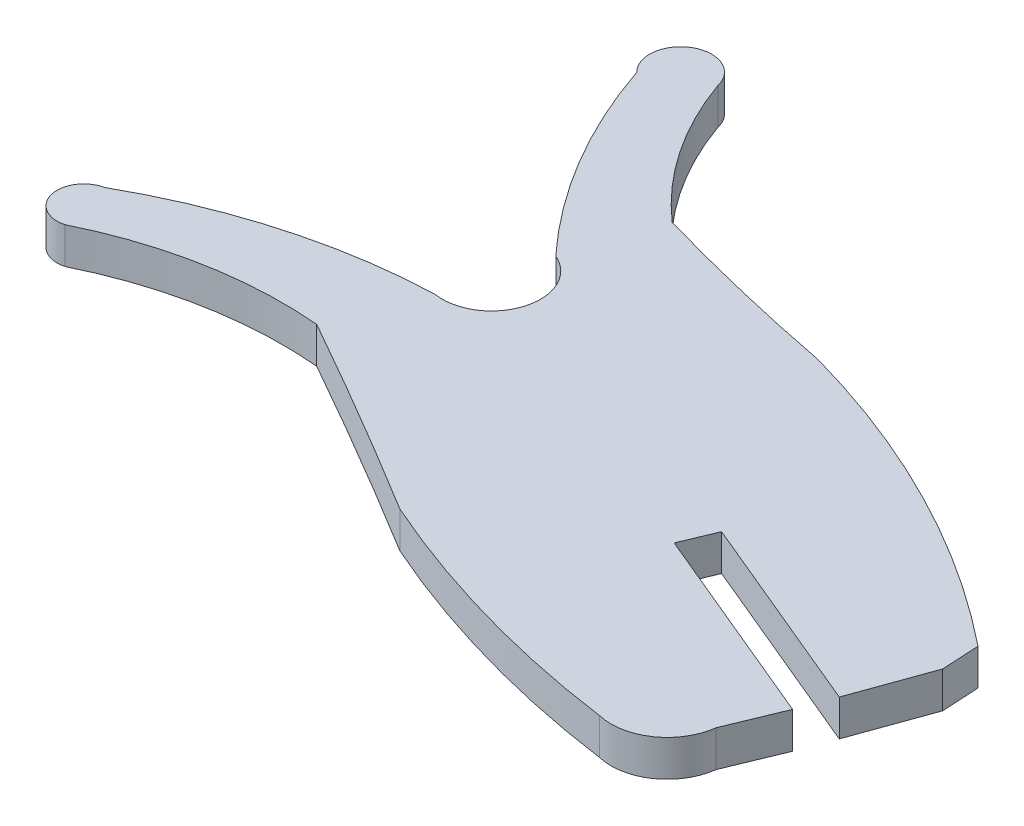
ISO-10303-21;
HEADER;
FILE_DESCRIPTION(('STEP AP214'),'2;1');
FILE_NAME('part.step','',(''),(''),'','','');
FILE_SCHEMA(('AUTOMOTIVE_DESIGN { 1 0 10303 214 1 1 1 1 }'));
ENDSEC;
DATA;
#1=APPLICATION_CONTEXT('core data for automotive mechanical design processes');
#2=APPLICATION_PROTOCOL_DEFINITION('international standard','automotive_design',2000,#1);
#3=PRODUCT_CONTEXT('',#1,'mechanical');
#4=PRODUCT('Part','Part','',(#3));
#5=PRODUCT_RELATED_PRODUCT_CATEGORY('part','',(#4));
#6=PRODUCT_DEFINITION_FORMATION('','',#4);
#7=PRODUCT_DEFINITION_CONTEXT('part definition',#1,'design');
#8=PRODUCT_DEFINITION('design','',#6,#7);
#9=PRODUCT_DEFINITION_SHAPE('','',#8);
#10=(LENGTH_UNIT() NAMED_UNIT(*) SI_UNIT(.MILLI.,.METRE.));
#11=(NAMED_UNIT(*) PLANE_ANGLE_UNIT() SI_UNIT($,.RADIAN.));
#12=(NAMED_UNIT(*) SI_UNIT($,.STERADIAN.) SOLID_ANGLE_UNIT());
#13=UNCERTAINTY_MEASURE_WITH_UNIT(LENGTH_MEASURE(1.E-05),#10,'distance_accuracy_value','');
#14=(GEOMETRIC_REPRESENTATION_CONTEXT(3) GLOBAL_UNCERTAINTY_ASSIGNED_CONTEXT((#13)) GLOBAL_UNIT_ASSIGNED_CONTEXT((#10,
#11,#12)) REPRESENTATION_CONTEXT('',''));
#15=CARTESIAN_POINT('',(0.,0.,0.));
#16=DIRECTION('',(0.,0.,1.));
#17=DIRECTION('',(1.,0.,0.));
#18=AXIS2_PLACEMENT_3D('',#15,#16,#17);
#19=CARTESIAN_POINT('',(-189.331030574793,2.,-516.512038011604));
#20=DIRECTION('',(0.,-1.,0.));
#21=DIRECTION('',(0.,0.,-1.));
#22=AXIS2_PLACEMENT_3D('',#19,#20,#21);
#23=CYLINDRICAL_SURFACE('',#22,2.70360510366939);
#24=CARTESIAN_POINT('',(-189.331030574793,0.,-516.512038011604));
#25=DIRECTION('',(0.,1.,0.));
#26=DIRECTION('',(0.,0.,1.));
#27=AXIS2_PLACEMENT_3D('',#24,#25,#26);
#28=CIRCLE('',#27,2.70360510366939);
#29=CARTESIAN_POINT('',(-189.764879999989,0.,-513.843469999946));
#30=VERTEX_POINT('',#29);
#31=CARTESIAN_POINT('',(-188.274059999991,0.,-519.000469999944));
#32=VERTEX_POINT('',#31);
#33=EDGE_CURVE('E11',#30,#32,#28,.T.);
#34=ORIENTED_EDGE('',*,*,#33,.F.);
#35=DIRECTION('',(0.,-1.,0.));
#36=VECTOR('',#35,1.);
#37=CARTESIAN_POINT('',(-189.764879999989,2.,-513.843469999946));
#38=LINE('',#37,#36);
#39=CARTESIAN_POINT('',(-189.764879999989,2.,-513.843469999946));
#40=VERTEX_POINT('',#39);
#41=EDGE_CURVE('E56',#40,#30,#38,.T.);
#42=ORIENTED_EDGE('',*,*,#41,.F.);
#43=CARTESIAN_POINT('',(-189.331030574793,2.,-516.512038011604));
#44=DIRECTION('',(0.,1.,0.));
#45=DIRECTION('',(0.,0.,1.));
#46=AXIS2_PLACEMENT_3D('',#43,#44,#45);
#47=CIRCLE('',#46,2.70360510366939);
#48=CARTESIAN_POINT('',(-188.274059999991,2.,-519.000469999944));
#49=VERTEX_POINT('',#48);
#50=EDGE_CURVE('E41',#40,#49,#47,.T.);
#51=ORIENTED_EDGE('',*,*,#50,.T.);
#52=DIRECTION('',(0.,-1.,0.));
#53=VECTOR('',#52,1.);
#54=CARTESIAN_POINT('',(-188.274059999991,2.,-519.000469999944));
#55=LINE('',#54,#53);
#56=EDGE_CURVE('E123',#49,#32,#55,.T.);
#57=ORIENTED_EDGE('',*,*,#56,.T.);
#58=EDGE_LOOP('',(#34,#42,#51,#57));
#59=FACE_BOUND('',#58,.T.);
#60=ADVANCED_FACE('F37',(#59),#23,.F.);
#61=CARTESIAN_POINT('',(-188.687048146685,2.,-482.811723343636));
#62=DIRECTION('',(0.,-1.,0.));
#63=DIRECTION('',(0.,0.,-1.));
#64=AXIS2_PLACEMENT_3D('',#61,#62,#63);
#65=CYLINDRICAL_SURFACE('',#64,31.0504592888);
#66=CARTESIAN_POINT('',(-188.687048146685,0.,-482.811723343636));
#67=DIRECTION('',(0.,1.,0.));
#68=DIRECTION('',(0.,0.,1.));
#69=AXIS2_PLACEMENT_3D('',#66,#67,#68);
#70=CIRCLE('',#69,31.0504592888);
#71=CARTESIAN_POINT('',(-203.984990000014,0.,-509.832159999945));
#72=VERTEX_POINT('',#71);
#73=EDGE_CURVE('E47',#30,#72,#70,.T.);
#74=ORIENTED_EDGE('',*,*,#73,.T.);
#75=DIRECTION('',(0.,-1.,0.));
#76=VECTOR('',#75,1.);
#77=CARTESIAN_POINT('',(-203.984990000014,2.,-509.832159999945));
#78=LINE('',#77,#76);
#79=CARTESIAN_POINT('',(-203.984990000014,2.,-509.832159999945));
#80=VERTEX_POINT('',#79);
#81=EDGE_CURVE('E182',#80,#72,#78,.T.);
#82=ORIENTED_EDGE('',*,*,#81,.F.);
#83=CARTESIAN_POINT('',(-188.687048146685,2.,-482.811723343636));
#84=DIRECTION('',(0.,1.,0.));
#85=DIRECTION('',(0.,0.,1.));
#86=AXIS2_PLACEMENT_3D('',#83,#84,#85);
#87=CIRCLE('',#86,31.0504592888);
#88=EDGE_CURVE('E113',#40,#80,#87,.T.);
#89=ORIENTED_EDGE('',*,*,#88,.F.);
#90=ORIENTED_EDGE('',*,*,#41,.T.);
#91=EDGE_LOOP('',(#74,#82,#89,#90));
#92=FACE_BOUND('',#91,.T.);
#93=ADVANCED_FACE('F325',(#92),#65,.T.);
#94=CARTESIAN_POINT('',(-203.690488443121,2.,-508.387803515514));
#95=DIRECTION('',(0.,-1.,0.));
#96=DIRECTION('',(0.,0.,-1.));
#97=AXIS2_PLACEMENT_3D('',#94,#95,#96);
#98=CYLINDRICAL_SURFACE('',#97,1.47407490350001);
#99=CARTESIAN_POINT('',(-203.690488443121,0.,-508.387803515514));
#100=DIRECTION('',(0.,1.,0.));
#101=DIRECTION('',(0.,0.,1.));
#102=AXIS2_PLACEMENT_3D('',#99,#100,#101);
#103=CIRCLE('',#102,1.47407490350001);
#104=CARTESIAN_POINT('',(-203.296920000032,0.,-506.967239999957));
#105=VERTEX_POINT('',#104);
#106=EDGE_CURVE('E186',#72,#105,#103,.T.);
#107=ORIENTED_EDGE('',*,*,#106,.T.);
#108=DIRECTION('',(0.,-1.,0.));
#109=VECTOR('',#108,1.);
#110=CARTESIAN_POINT('',(-203.296920000032,2.,-506.967239999957));
#111=LINE('',#110,#109);
#112=CARTESIAN_POINT('',(-203.296920000032,2.,-506.967239999957));
#113=VERTEX_POINT('',#112);
#114=EDGE_CURVE('E171',#113,#105,#111,.T.);
#115=ORIENTED_EDGE('',*,*,#114,.F.);
#116=CARTESIAN_POINT('',(-203.690488443121,2.,-508.387803515514));
#117=DIRECTION('',(0.,1.,0.));
#118=DIRECTION('',(0.,0.,1.));
#119=AXIS2_PLACEMENT_3D('',#116,#117,#118);
#120=CIRCLE('',#119,1.47407490350001);
#121=EDGE_CURVE('E232',#80,#113,#120,.T.);
#122=ORIENTED_EDGE('',*,*,#121,.F.);
#123=ORIENTED_EDGE('',*,*,#81,.T.);
#124=EDGE_LOOP('',(#107,#115,#122,#123));
#125=FACE_BOUND('',#124,.T.);
#126=ADVANCED_FACE('F187',(#125),#98,.T.);
#127=CARTESIAN_POINT('',(-193.56690373851,2.,-487.20429116561));
#128=DIRECTION('',(0.,-1.,0.));
#129=DIRECTION('',(0.,0.,-1.));
#130=AXIS2_PLACEMENT_3D('',#127,#128,#129);
#131=CYLINDRICAL_SURFACE('',#130,22.0283309190348);
#132=CARTESIAN_POINT('',(-193.56690373851,0.,-487.20429116561));
#133=DIRECTION('',(0.,1.,0.));
#134=DIRECTION('',(0.,0.,1.));
#135=AXIS2_PLACEMENT_3D('',#132,#133,#134);
#136=CIRCLE('',#135,22.0283309190348);
#137=CARTESIAN_POINT('',(-191.599730000241,0.,-509.144610000166));
#138=VERTEX_POINT('',#137);
#139=EDGE_CURVE('E175',#138,#105,#136,.T.);
#140=ORIENTED_EDGE('',*,*,#139,.F.);
#141=DIRECTION('',(0.,-1.,0.));
#142=VECTOR('',#141,1.);
#143=CARTESIAN_POINT('',(-191.599730000241,2.,-509.144610000166));
#144=LINE('',#143,#142);
#145=CARTESIAN_POINT('',(-191.599730000241,2.,-509.144610000166));
#146=VERTEX_POINT('',#145);
#147=EDGE_CURVE('E181',#146,#138,#144,.T.);
#148=ORIENTED_EDGE('',*,*,#147,.F.);
#149=CARTESIAN_POINT('',(-193.56690373851,2.,-487.20429116561));
#150=DIRECTION('',(0.,1.,0.));
#151=DIRECTION('',(0.,0.,1.));
#152=AXIS2_PLACEMENT_3D('',#149,#150,#151);
#153=CIRCLE('',#152,22.0283309190348);
#154=EDGE_CURVE('E178',#146,#113,#153,.T.);
#155=ORIENTED_EDGE('',*,*,#154,.T.);
#156=ORIENTED_EDGE('',*,*,#114,.T.);
#157=EDGE_LOOP('',(#140,#148,#155,#156));
#158=FACE_BOUND('',#157,.T.);
#159=ADVANCED_FACE('F173',(#158),#131,.F.);
#160=CARTESIAN_POINT('',(-358.8726292212,2.,-211.5661836702));
#161=DIRECTION('',(0.,-1.,0.));
#162=DIRECTION('',(0.,0.,-1.));
#163=AXIS2_PLACEMENT_3D('',#160,#161,#162);
#164=CYLINDRICAL_SURFACE('',#163,341.3695104001);
#165=CARTESIAN_POINT('',(-358.8726292212,0.,-211.5661836702));
#166=DIRECTION('',(0.,1.,0.));
#167=DIRECTION('',(0.,0.,1.));
#168=AXIS2_PLACEMENT_3D('',#165,#166,#167);
#169=CIRCLE('',#168,341.3695104001);
#170=CARTESIAN_POINT('',(-180.475929999748,0.,-502.612159999877));
#171=VERTEX_POINT('',#170);
#172=EDGE_CURVE('E193',#171,#138,#169,.T.);
#173=ORIENTED_EDGE('',*,*,#172,.F.);
#174=DIRECTION('',(0.,-1.,0.));
#175=VECTOR('',#174,1.);
#176=CARTESIAN_POINT('',(-180.475929999748,2.,-502.612159999877));
#177=LINE('',#176,#175);
#178=CARTESIAN_POINT('',(-180.475929999748,2.,-502.612159999877));
#179=VERTEX_POINT('',#178);
#180=EDGE_CURVE('E272',#179,#171,#177,.T.);
#181=ORIENTED_EDGE('',*,*,#180,.F.);
#182=CARTESIAN_POINT('',(-358.8726292212,2.,-211.5661836702));
#183=DIRECTION('',(0.,1.,0.));
#184=DIRECTION('',(0.,0.,1.));
#185=AXIS2_PLACEMENT_3D('',#182,#183,#184);
#186=CIRCLE('',#185,341.3695104001);
#187=EDGE_CURVE('E228',#179,#146,#186,.T.);
#188=ORIENTED_EDGE('',*,*,#187,.T.);
#189=ORIENTED_EDGE('',*,*,#147,.T.);
#190=EDGE_LOOP('',(#173,#181,#188,#189));
#191=FACE_BOUND('',#190,.T.);
#192=ADVANCED_FACE('F336',(#191),#164,.F.);
#193=CARTESIAN_POINT('',(-157.259326944354,2.,-555.246809134007));
#194=DIRECTION('',(0.,-1.,0.));
#195=DIRECTION('',(0.,0.,-1.));
#196=AXIS2_PLACEMENT_3D('',#193,#194,#195);
#197=CYLINDRICAL_SURFACE('',#196,57.5275320773);
#198=CARTESIAN_POINT('',(-157.259326944354,0.,-555.246809134007));
#199=DIRECTION('',(0.,1.,0.));
#200=DIRECTION('',(0.,0.,1.));
#201=AXIS2_PLACEMENT_3D('',#198,#199,#200);
#202=CIRCLE('',#201,57.5275320773);
#203=CARTESIAN_POINT('',(-165.109580000002,0.,-498.257420000002));
#204=VERTEX_POINT('',#203);
#205=EDGE_CURVE('E195',#171,#204,#202,.T.);
#206=ORIENTED_EDGE('',*,*,#205,.T.);
#207=DIRECTION('',(0.,-1.,0.));
#208=VECTOR('',#207,1.);
#209=CARTESIAN_POINT('',(-165.109580000002,2.,-498.257420000002));
#210=LINE('',#209,#208);
#211=CARTESIAN_POINT('',(-165.109580000002,2.,-498.257420000002));
#212=VERTEX_POINT('',#211);
#213=EDGE_CURVE('E270',#212,#204,#210,.T.);
#214=ORIENTED_EDGE('',*,*,#213,.F.);
#215=CARTESIAN_POINT('',(-157.259326944354,2.,-555.246809134007));
#216=DIRECTION('',(0.,1.,0.));
#217=DIRECTION('',(0.,0.,1.));
#218=AXIS2_PLACEMENT_3D('',#215,#216,#217);
#219=CIRCLE('',#218,57.5275320773);
#220=EDGE_CURVE('E226',#179,#212,#219,.T.);
#221=ORIENTED_EDGE('',*,*,#220,.F.);
#222=ORIENTED_EDGE('',*,*,#180,.T.);
#223=EDGE_LOOP('',(#206,#214,#221,#222));
#224=FACE_BOUND('',#223,.T.);
#225=ADVANCED_FACE('F268',(#224),#197,.T.);
#226=CARTESIAN_POINT('',(-164.399340185891,2.,-501.272309870571));
#227=DIRECTION('',(0.,-1.,0.));
#228=DIRECTION('',(0.,0.,-1.));
#229=AXIS2_PLACEMENT_3D('',#226,#227,#228);
#230=CYLINDRICAL_SURFACE('',#229,3.09741852599992);
#231=CARTESIAN_POINT('',(-164.399340185891,0.,-501.272309870571));
#232=DIRECTION('',(0.,1.,0.));
#233=DIRECTION('',(0.,0.,1.));
#234=AXIS2_PLACEMENT_3D('',#231,#232,#233);
#235=CIRCLE('',#234,3.09741852599992);
#236=CARTESIAN_POINT('',(-161.32520000002,0.,-500.893279999953));
#237=VERTEX_POINT('',#236);
#238=EDGE_CURVE('E264',#204,#237,#235,.T.);
#239=ORIENTED_EDGE('',*,*,#238,.T.);
#240=DIRECTION('',(0.,-1.,0.));
#241=VECTOR('',#240,1.);
#242=CARTESIAN_POINT('',(-161.32520000002,2.,-500.893279999953));
#243=LINE('',#242,#241);
#244=CARTESIAN_POINT('',(-161.32520000002,2.,-500.893279999953));
#245=VERTEX_POINT('',#244);
#246=EDGE_CURVE('E278',#245,#237,#243,.T.);
#247=ORIENTED_EDGE('',*,*,#246,.F.);
#248=CARTESIAN_POINT('',(-164.399340185891,2.,-501.272309870571));
#249=DIRECTION('',(0.,1.,0.));
#250=DIRECTION('',(0.,0.,1.));
#251=AXIS2_PLACEMENT_3D('',#248,#249,#250);
#252=CIRCLE('',#251,3.09741852599992);
#253=EDGE_CURVE('E224',#212,#245,#252,.T.);
#254=ORIENTED_EDGE('',*,*,#253,.F.);
#255=ORIENTED_EDGE('',*,*,#213,.T.);
#256=EDGE_LOOP('',(#239,#247,#254,#255));
#257=FACE_BOUND('',#256,.T.);
#258=ADVANCED_FACE('F275',(#257),#230,.T.);
#259=CARTESIAN_POINT('',(-189.302934555447,2.,-433.147941485963));
#260=DIRECTION('',(-0.924280853328213,0.,-0.381713117630074));
#261=DIRECTION('',(-0.381713117630074,0.,0.924280853328213));
#262=AXIS2_PLACEMENT_3D('',#259,#260,#261);
#263=PLANE('',#262);
#264=DIRECTION('',(0.381713117630074,0.,-0.924280853328213));
#265=VECTOR('',#264,1.);
#266=CARTESIAN_POINT('',(-189.302934555447,0.,-433.147941485963));
#267=LINE('',#266,#265);
#268=CARTESIAN_POINT('',(-160.09241,0.,-503.87836));
#269=VERTEX_POINT('',#268);
#270=EDGE_CURVE('E262',#237,#269,#267,.T.);
#271=ORIENTED_EDGE('',*,*,#270,.T.);
#272=DIRECTION('',(0.,-1.,0.));
#273=VECTOR('',#272,1.);
#274=CARTESIAN_POINT('',(-160.09241,2.,-503.87836));
#275=LINE('',#274,#273);
#276=CARTESIAN_POINT('',(-160.09241,2.,-503.87836));
#277=VERTEX_POINT('',#276);
#278=EDGE_CURVE('E288',#277,#269,#275,.T.);
#279=ORIENTED_EDGE('',*,*,#278,.F.);
#280=DIRECTION('',(0.381713117630074,0.,-0.924280853328213));
#281=VECTOR('',#280,1.);
#282=CARTESIAN_POINT('',(-189.302934555447,2.,-433.147941485963));
#283=LINE('',#282,#281);
#284=EDGE_CURVE('E222',#245,#277,#283,.T.);
#285=ORIENTED_EDGE('',*,*,#284,.F.);
#286=ORIENTED_EDGE('',*,*,#246,.T.);
#287=EDGE_LOOP('',(#271,#279,#285,#286));
#288=FACE_BOUND('',#287,.T.);
#289=ADVANCED_FACE('F286',(#288),#263,.F.);
#290=CARTESIAN_POINT('',(-495.810163266042,2.,-644.108561638343));
#291=DIRECTION('',(-0.385429779008039,0.,0.922737170300305));
#292=DIRECTION('',(0.922737170300305,0.,0.385429779008039));
#293=AXIS2_PLACEMENT_3D('',#290,#291,#292);
#294=PLANE('',#293);
#295=DIRECTION('',(-0.922737170300305,0.,-0.385429779008039));
#296=VECTOR('',#295,1.);
#297=CARTESIAN_POINT('',(-495.810163266042,0.,-644.108561638343));
#298=LINE('',#297,#296);
#299=CARTESIAN_POINT('',(-171.30699,0.,-508.56272));
#300=VERTEX_POINT('',#299);
#301=EDGE_CURVE('E260',#269,#300,#298,.T.);
#302=ORIENTED_EDGE('',*,*,#301,.T.);
#303=DIRECTION('',(0.,-1.,0.));
#304=VECTOR('',#303,1.);
#305=CARTESIAN_POINT('',(-171.30699,2.,-508.56272));
#306=LINE('',#305,#304);
#307=CARTESIAN_POINT('',(-171.30699,2.,-508.56272));
#308=VERTEX_POINT('',#307);
#309=EDGE_CURVE('E294',#308,#300,#306,.T.);
#310=ORIENTED_EDGE('',*,*,#309,.F.);
#311=DIRECTION('',(-0.922737170300305,0.,-0.385429779008039));
#312=VECTOR('',#311,1.);
#313=CARTESIAN_POINT('',(-495.810163266042,2.,-644.108561638343));
#314=LINE('',#313,#312);
#315=EDGE_CURVE('E220',#277,#308,#314,.T.);
#316=ORIENTED_EDGE('',*,*,#315,.F.);
#317=ORIENTED_EDGE('',*,*,#278,.T.);
#318=EDGE_LOOP('',(#302,#310,#316,#317));
#319=FACE_BOUND('',#318,.T.);
#320=ADVANCED_FACE('F291',(#319),#294,.F.);
#321=CARTESIAN_POINT('',(-201.366344857753,2.,-436.599019454008));
#322=DIRECTION('',(-0.922737512072332,0.,-0.385428960788579));
#323=DIRECTION('',(-0.385428960788579,0.,0.922737512072332));
#324=AXIS2_PLACEMENT_3D('',#321,#322,#323);
#325=PLANE('',#324);
#326=DIRECTION('',(0.385428960788579,0.,-0.922737512072332));
#327=VECTOR('',#326,1.);
#328=CARTESIAN_POINT('',(-201.366344857753,0.,-436.599019454008));
#329=LINE('',#328,#327);
#330=CARTESIAN_POINT('',(-170.536130000049,0.,-510.408199999883));
#331=VERTEX_POINT('',#330);
#332=EDGE_CURVE('E258',#300,#331,#329,.T.);
#333=ORIENTED_EDGE('',*,*,#332,.T.);
#334=DIRECTION('',(0.,-1.,0.));
#335=VECTOR('',#334,1.);
#336=CARTESIAN_POINT('',(-170.536130000049,2.,-510.408199999883));
#337=LINE('',#336,#335);
#338=CARTESIAN_POINT('',(-170.536130000049,2.,-510.408199999883));
#339=VERTEX_POINT('',#338);
#340=EDGE_CURVE('E296',#339,#331,#337,.T.);
#341=ORIENTED_EDGE('',*,*,#340,.F.);
#342=DIRECTION('',(0.385428960788579,0.,-0.922737512072332));
#343=VECTOR('',#342,1.);
#344=CARTESIAN_POINT('',(-201.366344857753,2.,-436.599019454008));
#345=LINE('',#344,#343);
#346=EDGE_CURVE('E218',#308,#339,#345,.T.);
#347=ORIENTED_EDGE('',*,*,#346,.F.);
#348=ORIENTED_EDGE('',*,*,#309,.T.);
#349=EDGE_LOOP('',(#333,#341,#347,#348));
#350=FACE_BOUND('',#349,.T.);
#351=ADVANCED_FACE('F348',(#350),#325,.F.);
#352=CARTESIAN_POINT('',(-495.03920428735,2.,-645.954177501292));
#353=DIRECTION('',(0.385430208045648,0.,-0.922736991090033));
#354=DIRECTION('',(-0.922736991090033,0.,-0.385430208045648));
#355=AXIS2_PLACEMENT_3D('',#352,#353,#354);
#356=PLANE('',#355);
#357=DIRECTION('',(0.922736991090033,0.,0.385430208045648));
#358=VECTOR('',#357,1.);
#359=CARTESIAN_POINT('',(-495.03920428735,0.,-645.954177501292));
#360=LINE('',#359,#358);
#361=CARTESIAN_POINT('',(-159.394989999998,0.,-505.754509999862));
#362=VERTEX_POINT('',#361);
#363=EDGE_CURVE('E256',#331,#362,#360,.T.);
#364=ORIENTED_EDGE('',*,*,#363,.T.);
#365=DIRECTION('',(0.,-1.,0.));
#366=VECTOR('',#365,1.);
#367=CARTESIAN_POINT('',(-159.394989999998,2.,-505.754509999862));
#368=LINE('',#367,#366);
#369=CARTESIAN_POINT('',(-159.394989999998,2.,-505.754509999862));
#370=VERTEX_POINT('',#369);
#371=EDGE_CURVE('E302',#370,#362,#368,.T.);
#372=ORIENTED_EDGE('',*,*,#371,.F.);
#373=DIRECTION('',(0.922736991090033,0.,0.385430208045648));
#374=VECTOR('',#373,1.);
#375=CARTESIAN_POINT('',(-495.03920428735,2.,-645.954177501292));
#376=LINE('',#375,#374);
#377=EDGE_CURVE('E216',#339,#370,#376,.T.);
#378=ORIENTED_EDGE('',*,*,#377,.F.);
#379=ORIENTED_EDGE('',*,*,#340,.T.);
#380=EDGE_LOOP('',(#364,#372,#378,#379));
#381=FACE_BOUND('',#380,.T.);
#382=ADVANCED_FACE('F351',(#381),#356,.F.);
#383=CARTESIAN_POINT('',(-180.316950714897,2.,-447.672218806522));
#384=DIRECTION('',(-0.940823713832527,0.,-0.338896355085696));
#385=DIRECTION('',(-0.338896355085696,0.,0.940823713832527));
#386=AXIS2_PLACEMENT_3D('',#383,#384,#385);
#387=PLANE('',#386);
#388=DIRECTION('',(0.338896355085696,0.,-0.940823713832527));
#389=VECTOR('',#388,1.);
#390=CARTESIAN_POINT('',(-180.316950714897,0.,-447.672218806522));
#391=LINE('',#390,#389);
#392=CARTESIAN_POINT('',(-157.884849999998,0.,-509.946869999862));
#393=VERTEX_POINT('',#392);
#394=EDGE_CURVE('E254',#362,#393,#391,.T.);
#395=ORIENTED_EDGE('',*,*,#394,.T.);
#396=DIRECTION('',(0.,-1.,0.));
#397=VECTOR('',#396,1.);
#398=CARTESIAN_POINT('',(-157.884849999998,2.,-509.946869999862));
#399=LINE('',#398,#397);
#400=CARTESIAN_POINT('',(-157.884849999998,2.,-509.946869999862));
#401=VERTEX_POINT('',#400);
#402=EDGE_CURVE('E305',#401,#393,#399,.T.);
#403=ORIENTED_EDGE('',*,*,#402,.F.);
#404=DIRECTION('',(0.338896355085696,0.,-0.940823713832527));
#405=VECTOR('',#404,1.);
#406=CARTESIAN_POINT('',(-180.316950714897,2.,-447.672218806522));
#407=LINE('',#406,#405);
#408=EDGE_CURVE('E214',#370,#401,#407,.T.);
#409=ORIENTED_EDGE('',*,*,#408,.F.);
#410=ORIENTED_EDGE('',*,*,#371,.T.);
#411=EDGE_LOOP('',(#395,#403,#409,#410));
#412=FACE_BOUND('',#411,.T.);
#413=ADVANCED_FACE('F355',(#412),#387,.F.);
#414=CARTESIAN_POINT('',(-162.466260842825,2.,-592.349144930665));
#415=DIRECTION('',(-0.998457999014542,0.,0.0555123788346087));
#416=DIRECTION('',(0.0555123788346087,0.,0.998457999014542));
#417=AXIS2_PLACEMENT_3D('',#414,#415,#416);
#418=PLANE('',#417);
#419=DIRECTION('',(-0.0555123788346087,0.,-0.998457999014542));
#420=VECTOR('',#419,1.);
#421=CARTESIAN_POINT('',(-162.466260842825,0.,-592.349144930665));
#422=LINE('',#421,#420);
#423=CARTESIAN_POINT('',(-157.999529999998,0.,-512.009529999862));
#424=VERTEX_POINT('',#423);
#425=EDGE_CURVE('E252',#393,#424,#422,.T.);
#426=ORIENTED_EDGE('',*,*,#425,.T.);
#427=DIRECTION('',(0.,-1.,0.));
#428=VECTOR('',#427,1.);
#429=CARTESIAN_POINT('',(-157.999529999998,2.,-512.009529999862));
#430=LINE('',#429,#428);
#431=CARTESIAN_POINT('',(-157.999529999998,2.,-512.009529999862));
#432=VERTEX_POINT('',#431);
#433=EDGE_CURVE('E308',#432,#424,#430,.T.);
#434=ORIENTED_EDGE('',*,*,#433,.F.);
#435=DIRECTION('',(-0.0555123788346087,0.,-0.998457999014542));
#436=VECTOR('',#435,1.);
#437=CARTESIAN_POINT('',(-162.466260842825,2.,-592.349144930665));
#438=LINE('',#437,#436);
#439=EDGE_CURVE('E212',#401,#432,#438,.T.);
#440=ORIENTED_EDGE('',*,*,#439,.F.);
#441=ORIENTED_EDGE('',*,*,#402,.T.);
#442=EDGE_LOOP('',(#426,#434,#440,#441));
#443=FACE_BOUND('',#442,.T.);
#444=ADVANCED_FACE('F359',(#443),#418,.F.);
#445=CARTESIAN_POINT('',(-189.620660142585,2.,-472.613960072914));
#446=DIRECTION('',(0.,-1.,0.));
#447=DIRECTION('',(0.,0.,-1.));
#448=AXIS2_PLACEMENT_3D('',#445,#446,#447);
#449=CYLINDRICAL_SURFACE('',#448,50.5164013105);
#450=CARTESIAN_POINT('',(-189.620660142585,0.,-472.613960072914));
#451=DIRECTION('',(0.,1.,0.));
#452=DIRECTION('',(0.,0.,1.));
#453=AXIS2_PLACEMENT_3D('',#450,#451,#452);
#454=CIRCLE('',#453,50.5164013105);
#455=CARTESIAN_POINT('',(-176.118709999927,0.,-521.292539999907));
#456=VERTEX_POINT('',#455);
#457=EDGE_CURVE('E249',#424,#456,#454,.T.);
#458=ORIENTED_EDGE('',*,*,#457,.T.);
#459=DIRECTION('',(0.,-1.,0.));
#460=VECTOR('',#459,1.);
#461=CARTESIAN_POINT('',(-176.118709999927,2.,-521.292539999907));
#462=LINE('',#461,#460);
#463=CARTESIAN_POINT('',(-176.118709999927,2.,-521.292539999907));
#464=VERTEX_POINT('',#463);
#465=EDGE_CURVE('E311',#464,#456,#462,.T.);
#466=ORIENTED_EDGE('',*,*,#465,.F.);
#467=CARTESIAN_POINT('',(-189.620660142585,2.,-472.613960072914));
#468=DIRECTION('',(0.,1.,0.));
#469=DIRECTION('',(0.,0.,1.));
#470=AXIS2_PLACEMENT_3D('',#467,#468,#469);
#471=CIRCLE('',#470,50.5164013105);
#472=EDGE_CURVE('E210',#432,#464,#471,.T.);
#473=ORIENTED_EDGE('',*,*,#472,.F.);
#474=ORIENTED_EDGE('',*,*,#433,.T.);
#475=EDGE_LOOP('',(#458,#466,#473,#474));
#476=FACE_BOUND('',#475,.T.);
#477=ADVANCED_FACE('F363',(#476),#449,.T.);
#478=CARTESIAN_POINT('',(-152.25934841562,2.,-644.466667672564));
#479=DIRECTION('',(0.,-1.,0.));
#480=DIRECTION('',(0.,0.,-1.));
#481=AXIS2_PLACEMENT_3D('',#478,#479,#480);
#482=CYLINDRICAL_SURFACE('',#481,125.463679457964);
#483=CARTESIAN_POINT('',(-152.25934841562,0.,-644.466667672564));
#484=DIRECTION('',(0.,1.,0.));
#485=DIRECTION('',(0.,0.,1.));
#486=AXIS2_PLACEMENT_3D('',#483,#484,#485);
#487=CIRCLE('',#486,125.463679457964);
#488=CARTESIAN_POINT('',(-186.668559999939,0.,-523.813689999917));
#489=VERTEX_POINT('',#488);
#490=EDGE_CURVE('E246',#489,#456,#487,.T.);
#491=ORIENTED_EDGE('',*,*,#490,.F.);
#492=DIRECTION('',(0.,-1.,0.));
#493=VECTOR('',#492,1.);
#494=CARTESIAN_POINT('',(-186.668559999939,2.,-523.813689999917));
#495=LINE('',#494,#493);
#496=CARTESIAN_POINT('',(-186.668559999939,2.,-523.813689999917));
#497=VERTEX_POINT('',#496);
#498=EDGE_CURVE('E313',#497,#489,#495,.T.);
#499=ORIENTED_EDGE('',*,*,#498,.F.);
#500=CARTESIAN_POINT('',(-152.25934841562,2.,-644.466667672564));
#501=DIRECTION('',(0.,1.,0.));
#502=DIRECTION('',(0.,0.,1.));
#503=AXIS2_PLACEMENT_3D('',#500,#501,#502);
#504=CIRCLE('',#503,125.463679457964);
#505=EDGE_CURVE('E207',#497,#464,#504,.T.);
#506=ORIENTED_EDGE('',*,*,#505,.T.);
#507=ORIENTED_EDGE('',*,*,#465,.T.);
#508=EDGE_LOOP('',(#491,#499,#506,#507));
#509=FACE_BOUND('',#508,.T.);
#510=ADVANCED_FACE('F367',(#509),#482,.F.);
#511=CARTESIAN_POINT('',(-174.404024957181,2.,-537.797512550032));
#512=DIRECTION('',(0.,-1.,0.));
#513=DIRECTION('',(0.,0.,-1.));
#514=AXIS2_PLACEMENT_3D('',#511,#512,#513);
#515=CYLINDRICAL_SURFACE('',#514,18.6001643252995);
#516=CARTESIAN_POINT('',(-174.404024957181,0.,-537.797512550032));
#517=DIRECTION('',(0.,1.,0.));
#518=DIRECTION('',(0.,0.,1.));
#519=AXIS2_PLACEMENT_3D('',#516,#517,#518);
#520=CIRCLE('',#519,18.6001643252995);
#521=CARTESIAN_POINT('',(-191.943759999937,0.,-531.606889999911));
#522=VERTEX_POINT('',#521);
#523=EDGE_CURVE('E239',#522,#489,#520,.T.);
#524=ORIENTED_EDGE('',*,*,#523,.F.);
#525=DIRECTION('',(0.,-1.,0.));
#526=VECTOR('',#525,1.);
#527=CARTESIAN_POINT('',(-191.943759999937,2.,-531.606889999911));
#528=LINE('',#527,#526);
#529=CARTESIAN_POINT('',(-191.943759999937,2.,-531.606889999911));
#530=VERTEX_POINT('',#529);
#531=EDGE_CURVE('E315',#530,#522,#528,.T.);
#532=ORIENTED_EDGE('',*,*,#531,.F.);
#533=CARTESIAN_POINT('',(-174.404024957181,2.,-537.797512550032));
#534=DIRECTION('',(0.,1.,0.));
#535=DIRECTION('',(0.,0.,1.));
#536=AXIS2_PLACEMENT_3D('',#533,#534,#535);
#537=CIRCLE('',#536,18.6001643252995);
#538=EDGE_CURVE('E204',#530,#497,#537,.T.);
#539=ORIENTED_EDGE('',*,*,#538,.T.);
#540=ORIENTED_EDGE('',*,*,#498,.T.);
#541=EDGE_LOOP('',(#524,#532,#539,#540));
#542=FACE_BOUND('',#541,.T.);
#543=ADVANCED_FACE('F371',(#542),#515,.F.);
#544=CARTESIAN_POINT('',(-193.61310103973,2.,-531.226059417883));
#545=DIRECTION('',(0.,-1.,0.));
#546=DIRECTION('',(0.,0.,-1.));
#547=AXIS2_PLACEMENT_3D('',#544,#545,#546);
#548=CYLINDRICAL_SURFACE('',#547,1.71222996100001);
#549=CARTESIAN_POINT('',(-193.61310103973,0.,-531.226059417883));
#550=DIRECTION('',(0.,1.,0.));
#551=DIRECTION('',(0.,0.,1.));
#552=AXIS2_PLACEMENT_3D('',#549,#550,#551);
#553=CIRCLE('',#552,1.71222996100001);
#554=CARTESIAN_POINT('',(-194.81071999992,0.,-530.002359999913));
#555=VERTEX_POINT('',#554);
#556=EDGE_CURVE('E234',#522,#555,#553,.T.);
#557=ORIENTED_EDGE('',*,*,#556,.T.);
#558=DIRECTION('',(0.,-1.,0.));
#559=VECTOR('',#558,1.);
#560=CARTESIAN_POINT('',(-194.81071999992,2.,-530.002359999913));
#561=LINE('',#560,#559);
#562=CARTESIAN_POINT('',(-194.81071999992,2.,-530.002359999913));
#563=VERTEX_POINT('',#562);
#564=EDGE_CURVE('E316',#563,#555,#561,.T.);
#565=ORIENTED_EDGE('',*,*,#564,.F.);
#566=CARTESIAN_POINT('',(-193.61310103973,2.,-531.226059417883));
#567=DIRECTION('',(0.,1.,0.));
#568=DIRECTION('',(0.,0.,1.));
#569=AXIS2_PLACEMENT_3D('',#566,#567,#568);
#570=CIRCLE('',#569,1.71222996100001);
#571=EDGE_CURVE('E202',#530,#563,#570,.T.);
#572=ORIENTED_EDGE('',*,*,#571,.F.);
#573=ORIENTED_EDGE('',*,*,#531,.T.);
#574=EDGE_LOOP('',(#557,#565,#572,#573));
#575=FACE_BOUND('',#574,.T.);
#576=ADVANCED_FACE('F375',(#575),#548,.T.);
#577=CARTESIAN_POINT('',(-165.877479035974,2.,-539.749958377517));
#578=DIRECTION('',(0.,-1.,0.));
#579=DIRECTION('',(0.,0.,-1.));
#580=AXIS2_PLACEMENT_3D('',#577,#578,#579);
#581=CYLINDRICAL_SURFACE('',#580,30.5311006485);
#582=CARTESIAN_POINT('',(-165.877479035974,0.,-539.749958377517));
#583=DIRECTION('',(0.,1.,0.));
#584=DIRECTION('',(0.,0.,1.));
#585=AXIS2_PLACEMENT_3D('',#582,#583,#584);
#586=CIRCLE('',#585,30.5311006485);
#587=EDGE_CURVE('E233',#555,#32,#586,.T.);
#588=ORIENTED_EDGE('',*,*,#587,.T.);
#589=ORIENTED_EDGE('',*,*,#56,.F.);
#590=CARTESIAN_POINT('',(-165.877479035974,2.,-539.749958377517));
#591=DIRECTION('',(0.,1.,0.));
#592=DIRECTION('',(0.,0.,1.));
#593=AXIS2_PLACEMENT_3D('',#590,#591,#592);
#594=CIRCLE('',#593,30.5311006485);
#595=EDGE_CURVE('E200',#563,#49,#594,.T.);
#596=ORIENTED_EDGE('',*,*,#595,.F.);
#597=ORIENTED_EDGE('',*,*,#564,.T.);
#598=EDGE_LOOP('',(#588,#589,#596,#597));
#599=FACE_BOUND('',#598,.T.);
#600=ADVANCED_FACE('F319',(#599),#581,.T.);
#601=CARTESIAN_POINT('',(-525.869702128861,2.,-572.1446));
#602=DIRECTION('',(0.,1.,0.));
#603=DIRECTION('',(0.,0.,1.));
#604=AXIS2_PLACEMENT_3D('',#601,#602,#603);
#605=PLANE('',#604);
#606=ORIENTED_EDGE('',*,*,#50,.F.);
#607=ORIENTED_EDGE('',*,*,#88,.T.);
#608=ORIENTED_EDGE('',*,*,#121,.T.);
#609=ORIENTED_EDGE('',*,*,#154,.F.);
#610=ORIENTED_EDGE('',*,*,#187,.F.);
#611=ORIENTED_EDGE('',*,*,#220,.T.);
#612=ORIENTED_EDGE('',*,*,#253,.T.);
#613=ORIENTED_EDGE('',*,*,#284,.T.);
#614=ORIENTED_EDGE('',*,*,#315,.T.);
#615=ORIENTED_EDGE('',*,*,#346,.T.);
#616=ORIENTED_EDGE('',*,*,#377,.T.);
#617=ORIENTED_EDGE('',*,*,#408,.T.);
#618=ORIENTED_EDGE('',*,*,#439,.T.);
#619=ORIENTED_EDGE('',*,*,#472,.T.);
#620=ORIENTED_EDGE('',*,*,#505,.F.);
#621=ORIENTED_EDGE('',*,*,#538,.F.);
#622=ORIENTED_EDGE('',*,*,#571,.T.);
#623=ORIENTED_EDGE('',*,*,#595,.T.);
#624=EDGE_LOOP('',(#606,#607,#608,#609,#610,#611,#612,#613,#614,#615,#616,#617,#618,#619,#620,
#621,#622,#623));
#625=FACE_BOUND('',#624,.T.);
#626=ADVANCED_FACE('F39',(#625),#605,.T.);
#627=CARTESIAN_POINT('',(-525.869702128861,0.,-572.1446));
#628=DIRECTION('',(0.,1.,0.));
#629=DIRECTION('',(0.,0.,1.));
#630=AXIS2_PLACEMENT_3D('',#627,#628,#629);
#631=PLANE('',#630);
#632=ORIENTED_EDGE('',*,*,#33,.T.);
#633=ORIENTED_EDGE('',*,*,#587,.F.);
#634=ORIENTED_EDGE('',*,*,#556,.F.);
#635=ORIENTED_EDGE('',*,*,#523,.T.);
#636=ORIENTED_EDGE('',*,*,#490,.T.);
#637=ORIENTED_EDGE('',*,*,#457,.F.);
#638=ORIENTED_EDGE('',*,*,#425,.F.);
#639=ORIENTED_EDGE('',*,*,#394,.F.);
#640=ORIENTED_EDGE('',*,*,#363,.F.);
#641=ORIENTED_EDGE('',*,*,#332,.F.);
#642=ORIENTED_EDGE('',*,*,#301,.F.);
#643=ORIENTED_EDGE('',*,*,#270,.F.);
#644=ORIENTED_EDGE('',*,*,#238,.F.);
#645=ORIENTED_EDGE('',*,*,#205,.F.);
#646=ORIENTED_EDGE('',*,*,#172,.T.);
#647=ORIENTED_EDGE('',*,*,#139,.T.);
#648=ORIENTED_EDGE('',*,*,#106,.F.);
#649=ORIENTED_EDGE('',*,*,#73,.F.);
#650=EDGE_LOOP('',(#632,#633,#634,#635,#636,#637,#638,#639,#640,#641,#642,#643,#644,#645,#646,
#647,#648,#649));
#651=FACE_BOUND('',#650,.T.);
#652=ADVANCED_FACE('F190',(#651),#631,.F.);
#653=CLOSED_SHELL('',(#60,#93,#126,#159,#192,#225,#258,#289,#320,#351,#382,#413,#444,#477,#510,
#543,#576,#600,#626,#652));
#654=MANIFOLD_SOLID_BREP('B2',#653);
#655=ADVANCED_BREP_SHAPE_REPRESENTATION('',(#18,#654),#14);
#656=SHAPE_DEFINITION_REPRESENTATION(#9,#655);
ENDSEC;
END-ISO-10303-21;
